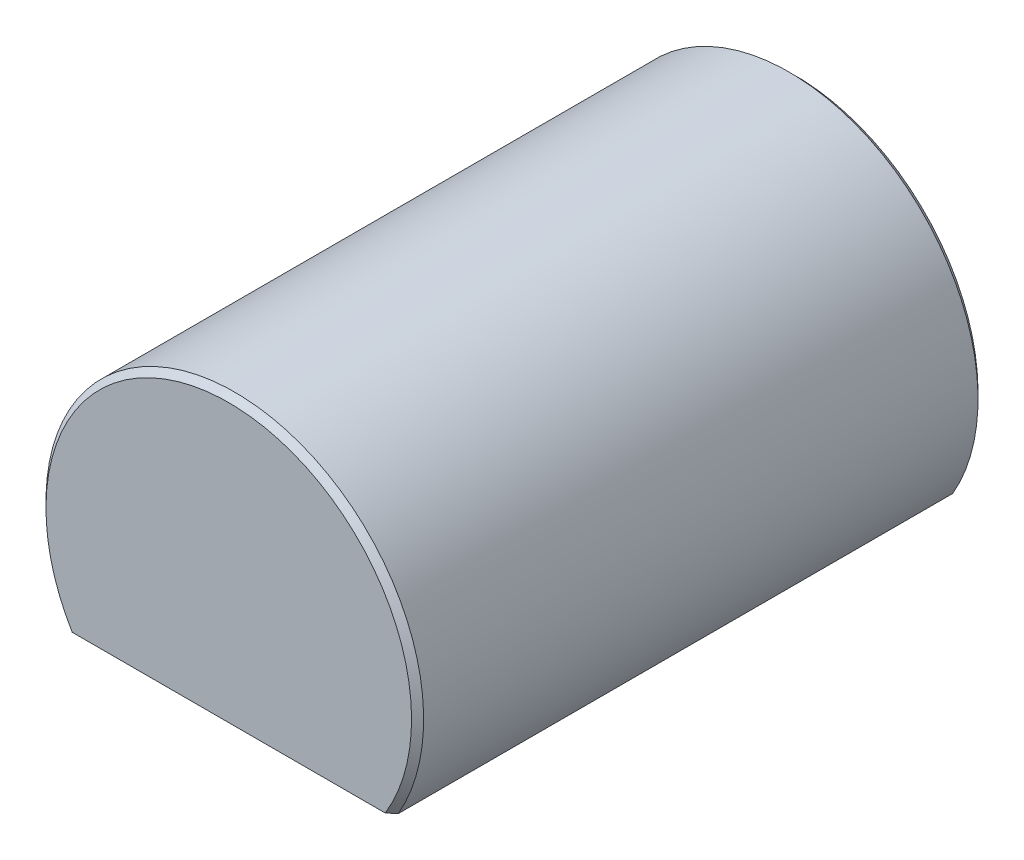
ISO-10303-21;
HEADER;
FILE_DESCRIPTION(('STEP AP214'),'2;1');
FILE_NAME('part.step','',(''),(''),'','','');
FILE_SCHEMA(('AUTOMOTIVE_DESIGN { 1 0 10303 214 1 1 1 1 }'));
ENDSEC;
DATA;
#1=APPLICATION_CONTEXT('core data for automotive mechanical design processes');
#2=APPLICATION_PROTOCOL_DEFINITION('international standard','automotive_design',2000,#1);
#3=PRODUCT_CONTEXT('',#1,'mechanical');
#4=PRODUCT('Part','Part','',(#3));
#5=PRODUCT_RELATED_PRODUCT_CATEGORY('part','',(#4));
#6=PRODUCT_DEFINITION_FORMATION('','',#4);
#7=PRODUCT_DEFINITION_CONTEXT('part definition',#1,'design');
#8=PRODUCT_DEFINITION('design','',#6,#7);
#9=PRODUCT_DEFINITION_SHAPE('','',#8);
#10=(LENGTH_UNIT() NAMED_UNIT(*) SI_UNIT(.MILLI.,.METRE.));
#11=(NAMED_UNIT(*) PLANE_ANGLE_UNIT() SI_UNIT($,.RADIAN.));
#12=(NAMED_UNIT(*) SI_UNIT($,.STERADIAN.) SOLID_ANGLE_UNIT());
#13=UNCERTAINTY_MEASURE_WITH_UNIT(LENGTH_MEASURE(1.E-05),#10,'distance_accuracy_value','');
#14=(GEOMETRIC_REPRESENTATION_CONTEXT(3) GLOBAL_UNCERTAINTY_ASSIGNED_CONTEXT((#13)) GLOBAL_UNIT_ASSIGNED_CONTEXT((#10,
#11,#12)) REPRESENTATION_CONTEXT('',''));
#15=CARTESIAN_POINT('',(0.,0.,0.));
#16=DIRECTION('',(0.,0.,1.));
#17=DIRECTION('',(1.,0.,0.));
#18=AXIS2_PLACEMENT_3D('',#15,#16,#17);
#19=CARTESIAN_POINT('',(0.,0.,19.05));
#20=DIRECTION('',(0.,0.,-1.));
#21=DIRECTION('',(-1.,0.,0.));
#22=AXIS2_PLACEMENT_3D('',#19,#20,#21);
#23=CYLINDRICAL_SURFACE('',#22,12.7);
#24=CARTESIAN_POINT('',(0.,0.,18.6436));
#25=DIRECTION('',(0.,0.,1.));
#26=DIRECTION('',(1.,0.,0.));
#27=AXIS2_PLACEMENT_3D('',#24,#25,#26);
#28=CIRCLE('',#27,12.7);
#29=CARTESIAN_POINT('',(-10.9985226280624,-6.35,18.6436));
#30=VERTEX_POINT('',#29);
#31=CARTESIAN_POINT('',(10.9985226280624,-6.35,18.6436));
#32=VERTEX_POINT('',#31);
#33=EDGE_CURVE('E224',#30,#32,#28,.F.);
#34=ORIENTED_EDGE('',*,*,#33,.T.);
#35=DIRECTION('',(0.,0.,1.));
#36=VECTOR('',#35,1.);
#37=CARTESIAN_POINT('',(10.9985226280624,-6.35,-19.05));
#38=LINE('',#37,#36);
#39=CARTESIAN_POINT('',(10.9985226280624,-6.35,-18.6436));
#40=VERTEX_POINT('',#39);
#41=EDGE_CURVE('E212',#40,#32,#38,.T.);
#42=ORIENTED_EDGE('',*,*,#41,.F.);
#43=CARTESIAN_POINT('',(0.,0.,-18.6436));
#44=DIRECTION('',(0.,0.,1.));
#45=DIRECTION('',(1.,0.,0.));
#46=AXIS2_PLACEMENT_3D('',#43,#44,#45);
#47=CIRCLE('',#46,12.7);
#48=CARTESIAN_POINT('',(-10.9985226280624,-6.35,-18.6436));
#49=VERTEX_POINT('',#48);
#50=EDGE_CURVE('E257',#40,#49,#47,.T.);
#51=ORIENTED_EDGE('',*,*,#50,.T.);
#52=DIRECTION('',(0.,0.,1.));
#53=VECTOR('',#52,1.);
#54=CARTESIAN_POINT('',(-10.9985226280624,-6.35,-19.05));
#55=LINE('',#54,#53);
#56=EDGE_CURVE('E213',#49,#30,#55,.T.);
#57=ORIENTED_EDGE('',*,*,#56,.T.);
#58=EDGE_LOOP('',(#34,#42,#51,#57));
#59=FACE_BOUND('',#58,.T.);
#60=ADVANCED_FACE('F44',(#59),#23,.T.);
#61=CARTESIAN_POINT('',(0.,0.,19.05));
#62=DIRECTION('',(0.,0.,1.));
#63=DIRECTION('',(1.,0.,0.));
#64=AXIS2_PLACEMENT_3D('',#61,#62,#63);
#65=PLANE('',#64);
#66=DIRECTION('',(-1.,0.,0.));
#67=VECTOR('',#66,1.);
#68=CARTESIAN_POINT('',(-10.9985226280624,-6.35,19.05));
#69=LINE('',#68,#67);
#70=CARTESIAN_POINT('',(10.5266376854151,-6.35,19.05));
#71=VERTEX_POINT('',#70);
#72=CARTESIAN_POINT('',(-10.5266376854151,-6.35,19.05));
#73=VERTEX_POINT('',#72);
#74=EDGE_CURVE('E70',#71,#73,#69,.T.);
#75=ORIENTED_EDGE('',*,*,#74,.F.);
#76=CARTESIAN_POINT('',(0.,0.,19.05));
#77=DIRECTION('',(0.,0.,1.));
#78=DIRECTION('',(1.,0.,0.));
#79=AXIS2_PLACEMENT_3D('',#76,#77,#78);
#80=CIRCLE('',#79,12.2936);
#81=EDGE_CURVE('E264',#71,#73,#80,.T.);
#82=ORIENTED_EDGE('',*,*,#81,.T.);
#83=EDGE_LOOP('',(#75,#82));
#84=FACE_BOUND('',#83,.T.);
#85=ADVANCED_FACE('F246',(#84),#65,.T.);
#86=CARTESIAN_POINT('',(0.,0.,-19.05));
#87=DIRECTION('',(0.,0.,1.));
#88=DIRECTION('',(1.,0.,0.));
#89=AXIS2_PLACEMENT_3D('',#86,#87,#88);
#90=PLANE('',#89);
#91=CARTESIAN_POINT('',(0.,0.,-19.05));
#92=DIRECTION('',(0.,0.,1.));
#93=DIRECTION('',(1.,0.,0.));
#94=AXIS2_PLACEMENT_3D('',#91,#92,#93);
#95=CIRCLE('',#94,12.2936);
#96=CARTESIAN_POINT('',(-10.526637685415,-6.35,-19.05));
#97=VERTEX_POINT('',#96);
#98=CARTESIAN_POINT('',(10.526637685415,-6.35,-19.05));
#99=VERTEX_POINT('',#98);
#100=EDGE_CURVE('E258',#97,#99,#95,.F.);
#101=ORIENTED_EDGE('',*,*,#100,.T.);
#102=DIRECTION('',(-1.,0.,0.));
#103=VECTOR('',#102,1.);
#104=CARTESIAN_POINT('',(-10.9985226280624,-6.35,-19.05));
#105=LINE('',#104,#103);
#106=EDGE_CURVE('E209',#99,#97,#105,.T.);
#107=ORIENTED_EDGE('',*,*,#106,.T.);
#108=EDGE_LOOP('',(#101,#107));
#109=FACE_BOUND('',#108,.T.);
#110=ADVANCED_FACE('F242',(#109),#90,.F.);
#111=CARTESIAN_POINT('',(0.,0.,-18.6436));
#112=DIRECTION('',(0.,0.,1.));
#113=DIRECTION('',(1.,0.,0.));
#114=AXIS2_PLACEMENT_3D('',#111,#112,#113);
#115=CONICAL_SURFACE('',#114,12.7,0.785398163397442);
#116=CARTESIAN_POINT('',(-24.1992020869911,-6.35,-6.32512919047518));
#117=CARTESIAN_POINT('',(-23.6509869382432,-6.35,-6.85536211490282));
#118=CARTESIAN_POINT('',(-23.1022195259497,-6.35,-7.3850259119345));
#119=CARTESIAN_POINT('',(-22.0032518881739,-6.35,-8.4428788365182));
#120=CARTESIAN_POINT('',(-21.4530516443648,-6.35,-8.97106794502742));
#121=CARTESIAN_POINT('',(-20.3506224641282,-6.35,-10.0258909359674));
#122=CARTESIAN_POINT('',(-19.7983926345171,-6.35,-10.5525238854843));
#123=CARTESIAN_POINT('',(-18.6917274795608,-6.35,-11.6034616447447));
#124=CARTESIAN_POINT('',(-18.137292168478,-6.35,-12.1277664694974));
#125=CARTESIAN_POINT('',(-17.0366040126244,-6.35,-13.163003750541));
#126=CARTESIAN_POINT('',(-16.4904067902598,-6.35,-13.673995283932));
#127=CARTESIAN_POINT('',(-15.3944600388377,-6.35,-14.692150934083));
#128=CARTESIAN_POINT('',(-14.8447105330624,-6.35,-15.1993150758811));
#129=CARTESIAN_POINT('',(-13.7405823590837,-6.35,-16.2083553586836));
#130=CARTESIAN_POINT('',(-13.186204711765,-6.35,-16.7102326133756));
#131=CARTESIAN_POINT('',(-12.3497282442751,-6.35,-17.4575372646986));
#132=CARTESIAN_POINT('',(-12.0700885559439,-6.35,-17.7057166804438));
#133=CARTESIAN_POINT('',(-11.5088464560665,-6.35,-18.1998445291344));
#134=CARTESIAN_POINT('',(-11.2272440558672,-6.35,-18.4457929749584));
#135=CARTESIAN_POINT('',(-10.5969624135506,-6.35,-18.9909633091477));
#136=CARTESIAN_POINT('',(-10.2476833254017,-6.35,-19.289493518483));
#137=CARTESIAN_POINT('',(-9.54458879262238,-6.35,-19.8812434064931));
#138=CARTESIAN_POINT('',(-9.19077290631746,-6.35,-20.174462561309));
#139=CARTESIAN_POINT('',(-8.47356142440316,-6.35,-20.7568486061746));
#140=CARTESIAN_POINT('',(-8.11010411470456,-6.35,-21.0459399692012));
#141=CARTESIAN_POINT('',(-7.55909736362113,-6.35,-21.4719742388111));
#142=CARTESIAN_POINT('',(-7.37447647856671,-6.35,-21.6127052705204));
#143=CARTESIAN_POINT('',(-7.00297084250384,-6.35,-21.8911427942339));
#144=CARTESIAN_POINT('',(-6.81608615464465,-6.35,-22.0288493703059));
#145=CARTESIAN_POINT('',(-6.43682749063955,-6.35,-22.3027052810092));
#146=CARTESIAN_POINT('',(-6.24441325957451,-6.35,-22.4387990002627));
#147=CARTESIAN_POINT('',(-5.8564322692381,-6.35,-22.7064380961386));
#148=CARTESIAN_POINT('',(-5.66086545306118,-6.35,-22.8379833905249));
#149=CARTESIAN_POINT('',(-5.2657814645494,-6.35,-23.0956613809701));
#150=CARTESIAN_POINT('',(-5.06625900347016,-6.35,-23.221786000267));
#151=CARTESIAN_POINT('',(-4.66295329999855,-6.35,-23.4670524572036));
#152=CARTESIAN_POINT('',(-4.45917018641911,-6.35,-23.5861945055354));
#153=CARTESIAN_POINT('',(-4.0492312955664,-6.35,-23.8143154853707));
#154=CARTESIAN_POINT('',(-3.84313533104228,-6.35,-23.9234012007971));
#155=CARTESIAN_POINT('',(-3.42551926054344,-6.35,-24.1308449085835));
#156=CARTESIAN_POINT('',(-3.21399817663017,-6.35,-24.2292009497729));
#157=CARTESIAN_POINT('',(-2.78570584733595,-6.35,-24.4121296213895));
#158=CARTESIAN_POINT('',(-2.56895075214375,-6.35,-24.4967396447411));
#159=CARTESIAN_POINT('',(-2.12967637485645,-6.35,-24.649149606542));
#160=CARTESIAN_POINT('',(-1.90716100368157,-6.35,-24.7169606362895));
#161=CARTESIAN_POINT('',(-1.47272595282641,-6.35,-24.82819255319));
#162=CARTESIAN_POINT('',(-1.26116512328854,-6.35,-24.8729958286679));
#163=CARTESIAN_POINT('',(-0.834711496630246,-6.35,-24.9424250095687));
#164=CARTESIAN_POINT('',(-0.619818997662833,-6.35,-24.9670527100164));
#165=CARTESIAN_POINT('',(-0.18928850574559,-6.35,-24.9943995966826));
#166=CARTESIAN_POINT('',(0.026345085604917,-6.35,-24.9971867287671));
#167=CARTESIAN_POINT('',(0.456779340605996,-6.35,-24.9808272545011));
#168=CARTESIAN_POINT('',(0.671579933993607,-6.35,-24.9616788366091));
#169=CARTESIAN_POINT('',(1.09646682262158,-6.35,-24.9030414129795));
#170=CARTESIAN_POINT('',(1.30657767963916,-6.35,-24.8637268724706));
#171=CARTESIAN_POINT('',(1.72260385715151,-6.35,-24.7672125308339));
#172=CARTESIAN_POINT('',(1.92851867132984,-6.35,-24.7100105847715));
#173=CARTESIAN_POINT('',(2.33665478300541,-6.35,-24.5801112651708));
#174=CARTESIAN_POINT('',(2.5388479916544,-6.35,-24.5073265787671));
#175=CARTESIAN_POINT('',(2.83831827105083,-6.35,-24.3887346605479));
#176=CARTESIAN_POINT('',(2.93750088542065,-6.35,-24.3476368616625));
#177=CARTESIAN_POINT('',(3.13463909757497,-6.35,-24.2626002566641));
#178=CARTESIAN_POINT('',(3.23259472739045,-6.35,-24.2186615249004));
#179=CARTESIAN_POINT('',(3.52549834595873,-6.35,-24.0826345249278));
#180=CARTESIAN_POINT('',(3.71865127699762,-6.35,-23.9866698350468));
#181=CARTESIAN_POINT('',(4.1006137972021,-6.35,-23.7864124806987));
#182=CARTESIAN_POINT('',(4.28942217162158,-6.35,-23.6821175226591));
#183=CARTESIAN_POINT('',(4.66333920449371,-6.35,-23.4666804926301));
#184=CARTESIAN_POINT('',(4.848443771116,-6.35,-23.3555313478273));
#185=CARTESIAN_POINT('',(5.21520828860432,-6.35,-23.1277465103858));
#186=CARTESIAN_POINT('',(5.3968685354703,-6.35,-23.0111112922386));
#187=CARTESIAN_POINT('',(5.75790576691564,-6.35,-22.7728644758562));
#188=CARTESIAN_POINT('',(5.93727107291164,-6.35,-22.6512352318846));
#189=CARTESIAN_POINT('',(6.29338840433545,-6.35,-22.4042027673661));
#190=CARTESIAN_POINT('',(6.47014030233793,-6.35,-22.2787993636965));
#191=CARTESIAN_POINT('',(6.99679616636329,-6.35,-21.8980397949156));
#192=CARTESIAN_POINT('',(7.34330974014444,-6.35,-21.6379939368018));
#193=CARTESIAN_POINT('',(8.03394500463411,-6.35,-21.1055363971089));
#194=CARTESIAN_POINT('',(8.37797520681622,-6.35,-20.8330070174027));
#195=CARTESIAN_POINT('',(9.06061752603271,-6.35,-20.2811886368277));
#196=CARTESIAN_POINT('',(9.39922905542985,-6.35,-20.0018989109638));
#197=CARTESIAN_POINT('',(10.0713681049486,-6.35,-19.4389217275967));
#198=CARTESIAN_POINT('',(10.4049059606438,-6.35,-19.1552465738132));
#199=CARTESIAN_POINT('',(11.0686076481266,-6.35,-18.5839718103142));
#200=CARTESIAN_POINT('',(11.3987714196197,-6.35,-18.2963721306815));
#201=CARTESIAN_POINT('',(12.2733033687245,-6.35,-17.5273541843027));
#202=CARTESIAN_POINT('',(12.8152958876095,-6.35,-17.0432364087762));
#203=CARTESIAN_POINT('',(13.8939451985488,-6.35,-16.0690830437521));
#204=CARTESIAN_POINT('',(14.430601840279,-6.35,-15.5790472883879));
#205=CARTESIAN_POINT('',(15.5004413346942,-6.35,-14.5941965456262));
#206=CARTESIAN_POINT('',(16.0336204396776,-6.35,-14.0993774917351));
#207=CARTESIAN_POINT('',(17.0969486752068,-6.35,-13.1064948854893));
#208=CARTESIAN_POINT('',(17.6270977956736,-6.35,-12.6084313223537));
#209=CARTESIAN_POINT('',(18.6632732828562,-6.35,-11.6303489647632));
#210=CARTESIAN_POINT('',(19.1693947389729,-6.35,-11.1504308320923));
#211=CARTESIAN_POINT('',(20.1799024318765,-6.35,-10.1887681540825));
#212=CARTESIAN_POINT('',(20.6842886618685,-6.35,-9.70702360160693));
#213=CARTESIAN_POINT('',(21.6910914964725,-6.35,-8.7426036389063));
#214=CARTESIAN_POINT('',(22.1935096704411,-6.35,-8.25992986619276));
#215=CARTESIAN_POINT('',(23.1971743219941,-6.35,-7.29337369723573));
#216=CARTESIAN_POINT('',(23.6984208091788,-6.35,-6.80949131096278));
#217=CARTESIAN_POINT('',(24.1992020869911,-6.35,-6.32512919047518));
#218=B_SPLINE_CURVE_WITH_KNOTS('',3,(#116,#117,#118,#119,#120,#121,#122,#123,#124,#125,#126,
#127,#128,#129,#130,#131,#132,#133,#134,#135,#136,#137,#138,#139,#140,#141,#142,#143,#144,#145,
#146,#147,#148,#149,#150,#151,#152,#153,#154,#155,#156,#157,#158,#159,#160,#161,#162,#163,#164,
#165,#166,#167,#168,#169,#170,#171,#172,#173,#174,#175,#176,#177,#178,#179,#180,#181,#182,#183,
#184,#185,#186,#187,#188,#189,#190,#191,#192,#193,#194,#195,#196,#197,#198,#199,#200,#201,#202,
#203,#204,#205,#206,#207,#208,#209,#210,#211,#212,#213,#214,#215,#216,#217),.UNSPECIFIED.,.F.,
.F.,(4,2,2,2,2,2,2,2,2,2,2,2,2,2,2,2,2,2,2,2,2,2,2,2,2,2,2,2,2,2,2,2,2,2,2,2,2,2,2,2,2,2,2,2,2,
2,2,2,2,2,4),(0.,2.28805336881564,4.57613614808476,6.86538843474583,9.15462594137594,
11.3984909706084,13.6423413081224,15.8857091243571,17.0073601614313,18.129004719402,
19.5073833086687,20.8858971228208,22.2789730455478,22.9753761209945,23.671759814658,
24.3787442432137,25.0857414474684,25.793757929867,26.5017530375627,27.2010591224712,
27.9004921636114,28.5979894894964,29.2950250679025,29.9429233493789,30.5907639809589,
31.2365883812855,31.8824661206971,32.5228480626012,33.1633068241647,33.8074527731334,
34.1294977853249,34.4515343727914,35.0982933003291,35.7452309179312,36.3928476569411,
37.0404084860913,37.690496693687,38.3406164946417,39.6401002682599,40.956685269107,
42.2734120946777,43.5869465851202,44.9005045073703,47.0806028372929,49.2607624125934,
51.442975300785,53.6251954436153,55.7176341799247,57.8100811007838,59.900194225184,
61.9902901636741),.UNSPECIFIED.);
#219=EDGE_CURVE('E223',#49,#97,#218,.T.);
#220=ORIENTED_EDGE('',*,*,#219,.F.);
#221=ORIENTED_EDGE('',*,*,#50,.F.);
#222=EDGE_CURVE('E216',#99,#40,#218,.T.);
#223=ORIENTED_EDGE('',*,*,#222,.F.);
#224=ORIENTED_EDGE('',*,*,#100,.F.);
#225=EDGE_LOOP('',(#220,#221,#223,#224));
#226=FACE_BOUND('',#225,.T.);
#227=ADVANCED_FACE('F226',(#226),#115,.T.);
#228=CARTESIAN_POINT('',(0.,0.,19.05));
#229=DIRECTION('',(0.,0.,-1.));
#230=DIRECTION('',(-1.,0.,0.));
#231=AXIS2_PLACEMENT_3D('',#228,#229,#230);
#232=CONICAL_SURFACE('',#231,12.2936,0.785398163397442);
#233=CARTESIAN_POINT('',(24.1992020869911,-6.35,6.32512919047524));
#234=CARTESIAN_POINT('',(23.6509869382432,-6.35,6.85536211490288));
#235=CARTESIAN_POINT('',(23.1022195259497,-6.35,7.38502591193456));
#236=CARTESIAN_POINT('',(22.0032518881738,-6.35,8.44287883651826));
#237=CARTESIAN_POINT('',(21.4530516443648,-6.35,8.97106794502748));
#238=CARTESIAN_POINT('',(20.3506224641281,-6.35,10.0258909359674));
#239=CARTESIAN_POINT('',(19.7983926345171,-6.35,10.5525238854844));
#240=CARTESIAN_POINT('',(18.6917274795608,-6.35,11.6034616447448));
#241=CARTESIAN_POINT('',(18.137292168478,-6.35,12.1277664694974));
#242=CARTESIAN_POINT('',(17.0366040126244,-6.35,13.163003750541));
#243=CARTESIAN_POINT('',(16.4904067902597,-6.35,13.6739952839321));
#244=CARTESIAN_POINT('',(15.3944600388377,-6.35,14.6921509340831));
#245=CARTESIAN_POINT('',(14.8447105330624,-6.35,15.1993150758812));
#246=CARTESIAN_POINT('',(13.7405823590837,-6.35,16.2083553586837));
#247=CARTESIAN_POINT('',(13.186204711765,-6.35,16.7102326133757));
#248=CARTESIAN_POINT('',(12.349728244275,-6.35,17.4575372646986));
#249=CARTESIAN_POINT('',(12.0700885559439,-6.35,17.7057166804439));
#250=CARTESIAN_POINT('',(11.5088464560665,-6.35,18.1998445291344));
#251=CARTESIAN_POINT('',(11.2272440558671,-6.35,18.4457929749585));
#252=CARTESIAN_POINT('',(10.5969624135505,-6.35,18.9909633091478));
#253=CARTESIAN_POINT('',(10.2476833254016,-6.35,19.289493518483));
#254=CARTESIAN_POINT('',(9.54458879262236,-6.35,19.8812434064932));
#255=CARTESIAN_POINT('',(9.19077290631744,-6.35,20.174462561309));
#256=CARTESIAN_POINT('',(8.47356142440313,-6.35,20.7568486061746));
#257=CARTESIAN_POINT('',(8.11010411470454,-6.35,21.0459399692013));
#258=CARTESIAN_POINT('',(7.55909736362111,-6.35,21.4719742388112));
#259=CARTESIAN_POINT('',(7.37447647856669,-6.35,21.6127052705205));
#260=CARTESIAN_POINT('',(7.00297084250382,-6.35,21.891142794234));
#261=CARTESIAN_POINT('',(6.81608615464463,-6.35,22.0288493703059));
#262=CARTESIAN_POINT('',(6.43682749063953,-6.35,22.3027052810092));
#263=CARTESIAN_POINT('',(6.2444132595745,-6.35,22.4387990002627));
#264=CARTESIAN_POINT('',(5.85643226923809,-6.35,22.7064380961386));
#265=CARTESIAN_POINT('',(5.66086545306117,-6.35,22.8379833905249));
#266=CARTESIAN_POINT('',(5.26578146454938,-6.35,23.0956613809701));
#267=CARTESIAN_POINT('',(5.06625900347014,-6.35,23.221786000267));
#268=CARTESIAN_POINT('',(4.66295329999853,-6.35,23.4670524572036));
#269=CARTESIAN_POINT('',(4.45917018641909,-6.35,23.5861945055355));
#270=CARTESIAN_POINT('',(4.04923129556639,-6.35,23.8143154853708));
#271=CARTESIAN_POINT('',(3.84313533104227,-6.35,23.9234012007971));
#272=CARTESIAN_POINT('',(3.42551926054343,-6.35,24.1308449085836));
#273=CARTESIAN_POINT('',(3.21399817663016,-6.35,24.229200949773));
#274=CARTESIAN_POINT('',(2.78570584733594,-6.35,24.4121296213896));
#275=CARTESIAN_POINT('',(2.56895075214374,-6.35,24.4967396447411));
#276=CARTESIAN_POINT('',(2.12967637485644,-6.35,24.6491496065421));
#277=CARTESIAN_POINT('',(1.90716100368155,-6.35,24.7169606362896));
#278=CARTESIAN_POINT('',(1.4727259528264,-6.35,24.8281925531901));
#279=CARTESIAN_POINT('',(1.26116512328853,-6.35,24.8729958286679));
#280=CARTESIAN_POINT('',(0.834711496630233,-6.35,24.9424250095688));
#281=CARTESIAN_POINT('',(0.619818997662819,-6.35,24.9670527100165));
#282=CARTESIAN_POINT('',(0.189288505745577,-6.35,24.9943995966827));
#283=CARTESIAN_POINT('',(-0.0263450856049303,-6.35,24.9971867287671));
#284=CARTESIAN_POINT('',(-0.456779340606009,-6.35,24.9808272545012));
#285=CARTESIAN_POINT('',(-0.67157993399362,-6.35,24.9616788366091));
#286=CARTESIAN_POINT('',(-1.09646682262159,-6.35,24.9030414129795));
#287=CARTESIAN_POINT('',(-1.30657767963917,-6.35,24.8637268724706));
#288=CARTESIAN_POINT('',(-1.72260385715152,-6.35,24.7672125308339));
#289=CARTESIAN_POINT('',(-1.92851867132985,-6.35,24.7100105847716));
#290=CARTESIAN_POINT('',(-2.33665478300541,-6.35,24.5801112651709));
#291=CARTESIAN_POINT('',(-2.53884799165441,-6.35,24.5073265787672));
#292=CARTESIAN_POINT('',(-2.83831827105084,-6.35,24.388734660548));
#293=CARTESIAN_POINT('',(-2.93750088542066,-6.35,24.3476368616625));
#294=CARTESIAN_POINT('',(-3.13463909757498,-6.35,24.2626002566642));
#295=CARTESIAN_POINT('',(-3.23259472739046,-6.35,24.2186615249004));
#296=CARTESIAN_POINT('',(-3.52549834595874,-6.35,24.0826345249279));
#297=CARTESIAN_POINT('',(-3.71865127699764,-6.35,23.9866698350468));
#298=CARTESIAN_POINT('',(-4.10061379720212,-6.35,23.7864124806988));
#299=CARTESIAN_POINT('',(-4.28942217162159,-6.35,23.6821175226591));
#300=CARTESIAN_POINT('',(-4.66333920449373,-6.35,23.4666804926302));
#301=CARTESIAN_POINT('',(-4.84844377111602,-6.35,23.3555313478273));
#302=CARTESIAN_POINT('',(-5.21520828860434,-6.35,23.1277465103858));
#303=CARTESIAN_POINT('',(-5.39686853547032,-6.35,23.0111112922386));
#304=CARTESIAN_POINT('',(-5.75790576691566,-6.35,22.7728644758562));
#305=CARTESIAN_POINT('',(-5.93727107291167,-6.35,22.6512352318846));
#306=CARTESIAN_POINT('',(-6.29338840433548,-6.35,22.4042027673661));
#307=CARTESIAN_POINT('',(-6.47014030233796,-6.35,22.2787993636965));
#308=CARTESIAN_POINT('',(-6.99679616636332,-6.35,21.8980397949156));
#309=CARTESIAN_POINT('',(-7.34330974014448,-6.35,21.6379939368018));
#310=CARTESIAN_POINT('',(-8.03394500463415,-6.35,21.1055363971089));
#311=CARTESIAN_POINT('',(-8.37797520681626,-6.35,20.8330070174027));
#312=CARTESIAN_POINT('',(-9.06061752603276,-6.35,20.2811886368278));
#313=CARTESIAN_POINT('',(-9.3992290554299,-6.35,20.0018989109638));
#314=CARTESIAN_POINT('',(-10.0713681049487,-6.35,19.4389217275967));
#315=CARTESIAN_POINT('',(-10.4049059606439,-6.35,19.1552465738132));
#316=CARTESIAN_POINT('',(-11.0686076481266,-6.35,18.5839718103142));
#317=CARTESIAN_POINT('',(-11.3987714196197,-6.35,18.2963721306815));
#318=CARTESIAN_POINT('',(-12.2733033687246,-6.35,17.5273541843027));
#319=CARTESIAN_POINT('',(-12.8152958876096,-6.35,17.0432364087762));
#320=CARTESIAN_POINT('',(-13.8939451985488,-6.35,16.0690830437521));
#321=CARTESIAN_POINT('',(-14.430601840279,-6.35,15.5790472883879));
#322=CARTESIAN_POINT('',(-15.5004413346942,-6.35,14.5941965456262));
#323=CARTESIAN_POINT('',(-16.0336204396777,-6.35,14.0993774917351));
#324=CARTESIAN_POINT('',(-17.0969486752068,-6.35,13.1064948854893));
#325=CARTESIAN_POINT('',(-17.6270977956736,-6.35,12.6084313223538));
#326=CARTESIAN_POINT('',(-18.6632732828563,-6.35,11.6303489647633));
#327=CARTESIAN_POINT('',(-19.1693947389729,-6.35,11.1504308320924));
#328=CARTESIAN_POINT('',(-20.1799024318766,-6.35,10.1887681540826));
#329=CARTESIAN_POINT('',(-20.6842886618686,-6.35,9.70702360160697));
#330=CARTESIAN_POINT('',(-21.6910914964725,-6.35,8.74260363890634));
#331=CARTESIAN_POINT('',(-22.1935096704411,-6.35,8.2599298661928));
#332=CARTESIAN_POINT('',(-23.1971743219942,-6.35,7.29337369723578));
#333=CARTESIAN_POINT('',(-23.6984208091788,-6.35,6.80949131096283));
#334=CARTESIAN_POINT('',(-24.1992020869911,-6.35,6.32512919047524));
#335=B_SPLINE_CURVE_WITH_KNOTS('',3,(#233,#234,#235,#236,#237,#238,#239,#240,#241,#242,#243,
#244,#245,#246,#247,#248,#249,#250,#251,#252,#253,#254,#255,#256,#257,#258,#259,#260,#261,#262,
#263,#264,#265,#266,#267,#268,#269,#270,#271,#272,#273,#274,#275,#276,#277,#278,#279,#280,#281,
#282,#283,#284,#285,#286,#287,#288,#289,#290,#291,#292,#293,#294,#295,#296,#297,#298,#299,#300,
#301,#302,#303,#304,#305,#306,#307,#308,#309,#310,#311,#312,#313,#314,#315,#316,#317,#318,#319,
#320,#321,#322,#323,#324,#325,#326,#327,#328,#329,#330,#331,#332,#333,#334),.UNSPECIFIED.,.F.,
.F.,(4,2,2,2,2,2,2,2,2,2,2,2,2,2,2,2,2,2,2,2,2,2,2,2,2,2,2,2,2,2,2,2,2,2,2,2,2,2,2,2,2,2,2,2,2,
2,2,2,2,2,4),(0.,2.28805336881564,4.57613614808477,6.86538843474584,9.15462594137595,
11.3984909706084,13.6423413081224,15.8857091243571,17.0073601614313,18.129004719402,
19.5073833086688,20.8858971228208,22.2789730455478,22.9753761209945,23.671759814658,
24.3787442432137,25.0857414474684,25.793757929867,26.5017530375627,27.2010591224712,
27.9004921636114,28.5979894894964,29.2950250679026,29.9429233493789,30.590763980959,
31.2365883812855,31.8824661206971,32.5228480626012,33.1633068241647,33.8074527731334,
34.1294977853249,34.4515343727914,35.0982933003291,35.7452309179312,36.3928476569411,
37.0404084860913,37.6904966936871,38.3406164946417,39.6401002682599,40.956685269107,
42.2734120946777,43.5869465851202,44.9005045073703,47.080602837293,49.2607624125935,
51.4429753007851,53.6251954436154,55.7176341799247,57.8100811007838,59.900194225184,
61.9902901636741),.UNSPECIFIED.);
#336=EDGE_CURVE('E13',#32,#71,#335,.T.);
#337=ORIENTED_EDGE('',*,*,#336,.F.);
#338=ORIENTED_EDGE('',*,*,#33,.F.);
#339=EDGE_CURVE('E47',#73,#30,#335,.T.);
#340=ORIENTED_EDGE('',*,*,#339,.F.);
#341=ORIENTED_EDGE('',*,*,#81,.F.);
#342=EDGE_LOOP('',(#337,#338,#340,#341));
#343=FACE_BOUND('',#342,.T.);
#344=ADVANCED_FACE('F233',(#343),#232,.T.);
#345=CARTESIAN_POINT('',(-10.9985226280624,-6.35,-19.05));
#346=DIRECTION('',(0.,1.,0.));
#347=DIRECTION('',(0.,0.,1.));
#348=AXIS2_PLACEMENT_3D('',#345,#346,#347);
#349=PLANE('',#348);
#350=DIRECTION('',(0.,0.,-1.));
#351=VECTOR('',#350,1.);
#352=CARTESIAN_POINT('',(-7.82352262806237,-6.35,15.367));
#353=LINE('',#352,#351);
#354=CARTESIAN_POINT('',(-7.82352262806237,-6.35,15.367));
#355=VERTEX_POINT('',#354);
#356=CARTESIAN_POINT('',(-7.82352262806237,-6.35,-15.367));
#357=VERTEX_POINT('',#356);
#358=EDGE_CURVE('E151',#355,#357,#353,.T.);
#359=ORIENTED_EDGE('',*,*,#358,.F.);
#360=CARTESIAN_POINT('',(-7.31552262806237,-6.35,15.367));
#361=DIRECTION('',(0.,-1.,0.));
#362=DIRECTION('',(0.,0.,-1.));
#363=AXIS2_PLACEMENT_3D('',#360,#361,#362);
#364=CIRCLE('',#363,0.508000000000002);
#365=CARTESIAN_POINT('',(-7.31552262806237,-6.35,15.875));
#366=VERTEX_POINT('',#365);
#367=EDGE_CURVE('E63',#366,#355,#364,.T.);
#368=ORIENTED_EDGE('',*,*,#367,.F.);
#369=DIRECTION('',(-1.,0.,0.));
#370=VECTOR('',#369,1.);
#371=CARTESIAN_POINT('',(7.31552262806237,-6.35,15.875));
#372=LINE('',#371,#370);
#373=CARTESIAN_POINT('',(7.31552262806237,-6.35,15.875));
#374=VERTEX_POINT('',#373);
#375=EDGE_CURVE('E172',#374,#366,#372,.T.);
#376=ORIENTED_EDGE('',*,*,#375,.F.);
#377=CARTESIAN_POINT('',(7.31552262806237,-6.35,15.367));
#378=DIRECTION('',(0.,-1.,0.));
#379=DIRECTION('',(0.,0.,1.));
#380=AXIS2_PLACEMENT_3D('',#377,#378,#379);
#381=CIRCLE('',#380,0.508000000000002);
#382=CARTESIAN_POINT('',(7.82352262806237,-6.35,15.367));
#383=VERTEX_POINT('',#382);
#384=EDGE_CURVE('E169',#383,#374,#381,.T.);
#385=ORIENTED_EDGE('',*,*,#384,.F.);
#386=DIRECTION('',(0.,0.,1.));
#387=VECTOR('',#386,1.);
#388=CARTESIAN_POINT('',(7.82352262806237,-6.35,15.367));
#389=LINE('',#388,#387);
#390=CARTESIAN_POINT('',(7.82352262806237,-6.35,-15.367));
#391=VERTEX_POINT('',#390);
#392=EDGE_CURVE('E166',#391,#383,#389,.T.);
#393=ORIENTED_EDGE('',*,*,#392,.F.);
#394=CARTESIAN_POINT('',(7.31552262806237,-6.35,-15.367));
#395=DIRECTION('',(0.,-1.,0.));
#396=DIRECTION('',(0.,0.,1.));
#397=AXIS2_PLACEMENT_3D('',#394,#395,#396);
#398=CIRCLE('',#397,0.508000000000003);
#399=CARTESIAN_POINT('',(7.31552262806237,-6.35,-15.875));
#400=VERTEX_POINT('',#399);
#401=EDGE_CURVE('E160',#400,#391,#398,.T.);
#402=ORIENTED_EDGE('',*,*,#401,.F.);
#403=DIRECTION('',(1.,0.,0.));
#404=VECTOR('',#403,1.);
#405=CARTESIAN_POINT('',(7.31552262806237,-6.35,-15.875));
#406=LINE('',#405,#404);
#407=CARTESIAN_POINT('',(-7.31552262806237,-6.35,-15.875));
#408=VERTEX_POINT('',#407);
#409=EDGE_CURVE('E158',#408,#400,#406,.T.);
#410=ORIENTED_EDGE('',*,*,#409,.F.);
#411=CARTESIAN_POINT('',(-7.31552262806237,-6.35,-15.367));
#412=DIRECTION('',(0.,-1.,0.));
#413=DIRECTION('',(0.,0.,1.));
#414=AXIS2_PLACEMENT_3D('',#411,#412,#413);
#415=CIRCLE('',#414,0.508000000000003);
#416=EDGE_CURVE('E140',#357,#408,#415,.T.);
#417=ORIENTED_EDGE('',*,*,#416,.F.);
#418=EDGE_LOOP('',(#359,#368,#376,#385,#393,#402,#410,#417));
#419=FACE_BOUND('',#418,.T.);
#420=ORIENTED_EDGE('',*,*,#219,.T.);
#421=ORIENTED_EDGE('',*,*,#106,.F.);
#422=ORIENTED_EDGE('',*,*,#222,.T.);
#423=ORIENTED_EDGE('',*,*,#41,.T.);
#424=ORIENTED_EDGE('',*,*,#336,.T.);
#425=ORIENTED_EDGE('',*,*,#74,.T.);
#426=ORIENTED_EDGE('',*,*,#339,.T.);
#427=ORIENTED_EDGE('',*,*,#56,.F.);
#428=EDGE_LOOP('',(#420,#421,#422,#423,#424,#425,#426,#427));
#429=FACE_BOUND('',#428,.T.);
#430=ADVANCED_FACE('F155',(#419,#429),#349,.F.);
#431=CARTESIAN_POINT('',(-7.31552262806237,-6.223,15.367));
#432=DIRECTION('',(0.,-1.,0.));
#433=DIRECTION('',(0.,0.,-1.));
#434=AXIS2_PLACEMENT_3D('',#431,#432,#433);
#435=CYLINDRICAL_SURFACE('',#434,0.508000000000002);
#436=ORIENTED_EDGE('',*,*,#367,.T.);
#437=DIRECTION('',(0.,-1.,0.));
#438=VECTOR('',#437,1.);
#439=CARTESIAN_POINT('',(-7.82352262806237,-6.223,15.367));
#440=LINE('',#439,#438);
#441=CARTESIAN_POINT('',(-7.82352262806237,-6.223,15.367));
#442=VERTEX_POINT('',#441);
#443=EDGE_CURVE('E148',#442,#355,#440,.T.);
#444=ORIENTED_EDGE('',*,*,#443,.F.);
#445=CARTESIAN_POINT('',(-7.31552262806237,-6.223,15.367));
#446=DIRECTION('',(0.,-1.,0.));
#447=DIRECTION('',(0.,0.,-1.));
#448=AXIS2_PLACEMENT_3D('',#445,#446,#447);
#449=CIRCLE('',#448,0.508000000000002);
#450=CARTESIAN_POINT('',(-7.31552262806237,-6.223,15.875));
#451=VERTEX_POINT('',#450);
#452=EDGE_CURVE('E175',#451,#442,#449,.T.);
#453=ORIENTED_EDGE('',*,*,#452,.F.);
#454=DIRECTION('',(0.,-1.,0.));
#455=VECTOR('',#454,1.);
#456=CARTESIAN_POINT('',(-7.31552262806237,-6.223,15.875));
#457=LINE('',#456,#455);
#458=EDGE_CURVE('E196',#451,#366,#457,.T.);
#459=ORIENTED_EDGE('',*,*,#458,.T.);
#460=EDGE_LOOP('',(#436,#444,#453,#459));
#461=FACE_BOUND('',#460,.T.);
#462=ADVANCED_FACE('F232',(#461),#435,.F.);
#463=CARTESIAN_POINT('',(7.31552262806237,-6.223,15.875));
#464=DIRECTION('',(0.,0.,1.));
#465=DIRECTION('',(1.,0.,0.));
#466=AXIS2_PLACEMENT_3D('',#463,#464,#465);
#467=PLANE('',#466);
#468=ORIENTED_EDGE('',*,*,#375,.T.);
#469=ORIENTED_EDGE('',*,*,#458,.F.);
#470=DIRECTION('',(-1.,0.,0.));
#471=VECTOR('',#470,1.);
#472=CARTESIAN_POINT('',(7.31552262806237,-6.223,15.875));
#473=LINE('',#472,#471);
#474=CARTESIAN_POINT('',(7.31552262806237,-6.223,15.875));
#475=VERTEX_POINT('',#474);
#476=EDGE_CURVE('E193',#475,#451,#473,.T.);
#477=ORIENTED_EDGE('',*,*,#476,.F.);
#478=DIRECTION('',(0.,-1.,0.));
#479=VECTOR('',#478,1.);
#480=CARTESIAN_POINT('',(7.31552262806237,-6.223,15.875));
#481=LINE('',#480,#479);
#482=EDGE_CURVE('E198',#475,#374,#481,.T.);
#483=ORIENTED_EDGE('',*,*,#482,.T.);
#484=EDGE_LOOP('',(#468,#469,#477,#483));
#485=FACE_BOUND('',#484,.T.);
#486=ADVANCED_FACE('F296',(#485),#467,.F.);
#487=CARTESIAN_POINT('',(7.31552262806237,-6.223,15.367));
#488=DIRECTION('',(0.,-1.,0.));
#489=DIRECTION('',(0.,0.,-1.));
#490=AXIS2_PLACEMENT_3D('',#487,#488,#489);
#491=CYLINDRICAL_SURFACE('',#490,0.508000000000002);
#492=ORIENTED_EDGE('',*,*,#384,.T.);
#493=ORIENTED_EDGE('',*,*,#482,.F.);
#494=CARTESIAN_POINT('',(7.31552262806237,-6.223,15.367));
#495=DIRECTION('',(0.,-1.,0.));
#496=DIRECTION('',(0.,0.,1.));
#497=AXIS2_PLACEMENT_3D('',#494,#495,#496);
#498=CIRCLE('',#497,0.508000000000002);
#499=CARTESIAN_POINT('',(7.82352262806237,-6.223,15.367));
#500=VERTEX_POINT('',#499);
#501=EDGE_CURVE('E190',#500,#475,#498,.T.);
#502=ORIENTED_EDGE('',*,*,#501,.F.);
#503=DIRECTION('',(0.,-1.,0.));
#504=VECTOR('',#503,1.);
#505=CARTESIAN_POINT('',(7.82352262806237,-6.223,15.367));
#506=LINE('',#505,#504);
#507=EDGE_CURVE('E200',#500,#383,#506,.T.);
#508=ORIENTED_EDGE('',*,*,#507,.T.);
#509=EDGE_LOOP('',(#492,#493,#502,#508));
#510=FACE_BOUND('',#509,.T.);
#511=ADVANCED_FACE('F304',(#510),#491,.F.);
#512=CARTESIAN_POINT('',(7.82352262806237,-6.223,15.367));
#513=DIRECTION('',(1.,0.,0.));
#514=DIRECTION('',(0.,0.,-1.));
#515=AXIS2_PLACEMENT_3D('',#512,#513,#514);
#516=PLANE('',#515);
#517=ORIENTED_EDGE('',*,*,#392,.T.);
#518=ORIENTED_EDGE('',*,*,#507,.F.);
#519=DIRECTION('',(0.,0.,1.));
#520=VECTOR('',#519,1.);
#521=CARTESIAN_POINT('',(7.82352262806237,-6.223,15.367));
#522=LINE('',#521,#520);
#523=CARTESIAN_POINT('',(7.82352262806237,-6.223,-15.367));
#524=VERTEX_POINT('',#523);
#525=EDGE_CURVE('E187',#524,#500,#522,.T.);
#526=ORIENTED_EDGE('',*,*,#525,.F.);
#527=DIRECTION('',(0.,-1.,0.));
#528=VECTOR('',#527,1.);
#529=CARTESIAN_POINT('',(7.82352262806237,-6.223,-15.367));
#530=LINE('',#529,#528);
#531=EDGE_CURVE('E202',#524,#391,#530,.T.);
#532=ORIENTED_EDGE('',*,*,#531,.T.);
#533=EDGE_LOOP('',(#517,#518,#526,#532));
#534=FACE_BOUND('',#533,.T.);
#535=ADVANCED_FACE('F314',(#534),#516,.F.);
#536=CARTESIAN_POINT('',(7.31552262806237,-6.223,-15.367));
#537=DIRECTION('',(0.,-1.,0.));
#538=DIRECTION('',(0.,0.,-1.));
#539=AXIS2_PLACEMENT_3D('',#536,#537,#538);
#540=CYLINDRICAL_SURFACE('',#539,0.508000000000003);
#541=ORIENTED_EDGE('',*,*,#401,.T.);
#542=ORIENTED_EDGE('',*,*,#531,.F.);
#543=CARTESIAN_POINT('',(7.31552262806237,-6.223,-15.367));
#544=DIRECTION('',(0.,-1.,0.));
#545=DIRECTION('',(0.,0.,1.));
#546=AXIS2_PLACEMENT_3D('',#543,#544,#545);
#547=CIRCLE('',#546,0.508000000000003);
#548=CARTESIAN_POINT('',(7.31552262806237,-6.223,-15.875));
#549=VERTEX_POINT('',#548);
#550=EDGE_CURVE('E184',#549,#524,#547,.T.);
#551=ORIENTED_EDGE('',*,*,#550,.F.);
#552=DIRECTION('',(0.,-1.,0.));
#553=VECTOR('',#552,1.);
#554=CARTESIAN_POINT('',(7.31552262806237,-6.223,-15.875));
#555=LINE('',#554,#553);
#556=EDGE_CURVE('E204',#549,#400,#555,.T.);
#557=ORIENTED_EDGE('',*,*,#556,.T.);
#558=EDGE_LOOP('',(#541,#542,#551,#557));
#559=FACE_BOUND('',#558,.T.);
#560=ADVANCED_FACE('F324',(#559),#540,.F.);
#561=CARTESIAN_POINT('',(7.31552262806237,-6.223,-15.875));
#562=DIRECTION('',(0.,0.,-1.));
#563=DIRECTION('',(-1.,0.,0.));
#564=AXIS2_PLACEMENT_3D('',#561,#562,#563);
#565=PLANE('',#564);
#566=ORIENTED_EDGE('',*,*,#409,.T.);
#567=ORIENTED_EDGE('',*,*,#556,.F.);
#568=DIRECTION('',(1.,0.,0.));
#569=VECTOR('',#568,1.);
#570=CARTESIAN_POINT('',(7.31552262806237,-6.223,-15.875));
#571=LINE('',#570,#569);
#572=CARTESIAN_POINT('',(-7.31552262806237,-6.223,-15.875));
#573=VERTEX_POINT('',#572);
#574=EDGE_CURVE('E181',#573,#549,#571,.T.);
#575=ORIENTED_EDGE('',*,*,#574,.F.);
#576=DIRECTION('',(0.,-1.,0.));
#577=VECTOR('',#576,1.);
#578=CARTESIAN_POINT('',(-7.31552262806237,-6.223,-15.875));
#579=LINE('',#578,#577);
#580=EDGE_CURVE('E147',#573,#408,#579,.T.);
#581=ORIENTED_EDGE('',*,*,#580,.T.);
#582=EDGE_LOOP('',(#566,#567,#575,#581));
#583=FACE_BOUND('',#582,.T.);
#584=ADVANCED_FACE('F334',(#583),#565,.F.);
#585=CARTESIAN_POINT('',(-7.31552262806237,-6.223,-15.367));
#586=DIRECTION('',(0.,-1.,0.));
#587=DIRECTION('',(0.,0.,-1.));
#588=AXIS2_PLACEMENT_3D('',#585,#586,#587);
#589=CYLINDRICAL_SURFACE('',#588,0.508000000000003);
#590=ORIENTED_EDGE('',*,*,#416,.T.);
#591=ORIENTED_EDGE('',*,*,#580,.F.);
#592=CARTESIAN_POINT('',(-7.31552262806237,-6.223,-15.367));
#593=DIRECTION('',(0.,-1.,0.));
#594=DIRECTION('',(0.,0.,1.));
#595=AXIS2_PLACEMENT_3D('',#592,#593,#594);
#596=CIRCLE('',#595,0.508000000000003);
#597=CARTESIAN_POINT('',(-7.82352262806237,-6.223,-15.367));
#598=VERTEX_POINT('',#597);
#599=EDGE_CURVE('E143',#598,#573,#596,.T.);
#600=ORIENTED_EDGE('',*,*,#599,.F.);
#601=DIRECTION('',(0.,-1.,0.));
#602=VECTOR('',#601,1.);
#603=CARTESIAN_POINT('',(-7.82352262806237,-6.223,-15.367));
#604=LINE('',#603,#602);
#605=EDGE_CURVE('E136',#598,#357,#604,.T.);
#606=ORIENTED_EDGE('',*,*,#605,.T.);
#607=EDGE_LOOP('',(#590,#591,#600,#606));
#608=FACE_BOUND('',#607,.T.);
#609=ADVANCED_FACE('F138',(#608),#589,.F.);
#610=CARTESIAN_POINT('',(-7.82352262806237,-6.223,15.367));
#611=DIRECTION('',(-1.,0.,0.));
#612=DIRECTION('',(0.,0.,1.));
#613=AXIS2_PLACEMENT_3D('',#610,#611,#612);
#614=PLANE('',#613);
#615=ORIENTED_EDGE('',*,*,#358,.T.);
#616=ORIENTED_EDGE('',*,*,#605,.F.);
#617=DIRECTION('',(0.,0.,-1.));
#618=VECTOR('',#617,1.);
#619=CARTESIAN_POINT('',(-7.82352262806237,-6.223,15.367));
#620=LINE('',#619,#618);
#621=EDGE_CURVE('E178',#442,#598,#620,.T.);
#622=ORIENTED_EDGE('',*,*,#621,.F.);
#623=ORIENTED_EDGE('',*,*,#443,.T.);
#624=EDGE_LOOP('',(#615,#616,#622,#623));
#625=FACE_BOUND('',#624,.T.);
#626=ADVANCED_FACE('F152',(#625),#614,.F.);
#627=CARTESIAN_POINT('',(-7.31552262806237,-6.223,15.367));
#628=DIRECTION('',(0.,-1.,0.));
#629=DIRECTION('',(0.,0.,-1.));
#630=AXIS2_PLACEMENT_3D('',#627,#628,#629);
#631=PLANE('',#630);
#632=ORIENTED_EDGE('',*,*,#452,.T.);
#633=ORIENTED_EDGE('',*,*,#621,.T.);
#634=ORIENTED_EDGE('',*,*,#599,.T.);
#635=ORIENTED_EDGE('',*,*,#574,.T.);
#636=ORIENTED_EDGE('',*,*,#550,.T.);
#637=ORIENTED_EDGE('',*,*,#525,.T.);
#638=ORIENTED_EDGE('',*,*,#501,.T.);
#639=ORIENTED_EDGE('',*,*,#476,.T.);
#640=EDGE_LOOP('',(#632,#633,#634,#635,#636,#637,#638,#639));
#641=FACE_BOUND('',#640,.T.);
#642=ADVANCED_FACE('F361',(#641),#631,.T.);
#643=CLOSED_SHELL('',(#60,#85,#110,#227,#344,#430,#462,#486,#511,#535,#560,#584,#609,#626,#642));
#644=MANIFOLD_SOLID_BREP('B2',#643);
#645=ADVANCED_BREP_SHAPE_REPRESENTATION('',(#18,#644),#14);
#646=SHAPE_DEFINITION_REPRESENTATION(#9,#645);
ENDSEC;
END-ISO-10303-21;
